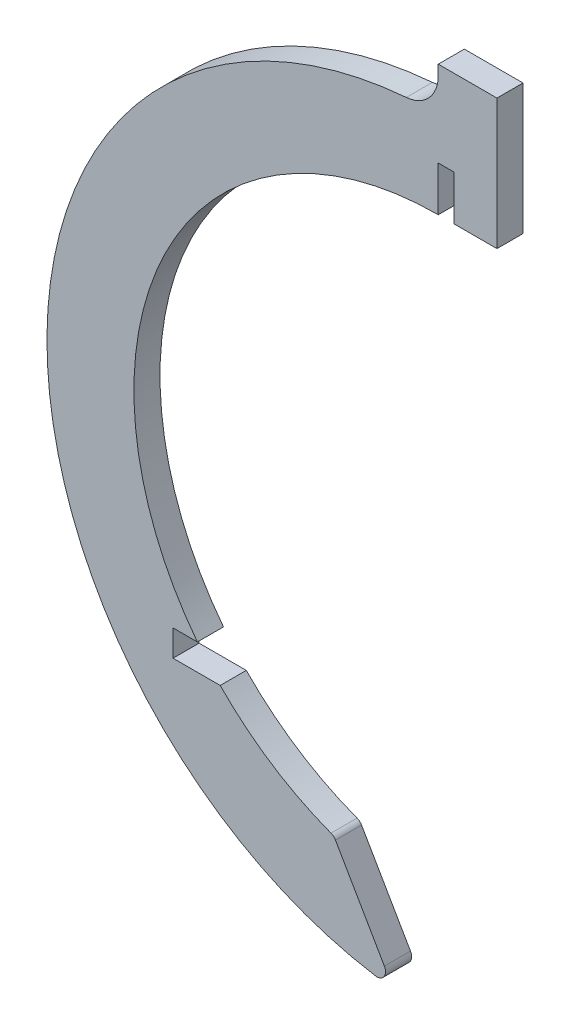
ISO-10303-21;
HEADER;
FILE_DESCRIPTION(('STEP AP214'),'2;1');
FILE_NAME('part.step','',(''),(''),'','','');
FILE_SCHEMA(('AUTOMOTIVE_DESIGN { 1 0 10303 214 1 1 1 1 }'));
ENDSEC;
DATA;
#1=APPLICATION_CONTEXT('core data for automotive mechanical design processes');
#2=APPLICATION_PROTOCOL_DEFINITION('international standard','automotive_design',2000,#1);
#3=PRODUCT_CONTEXT('',#1,'mechanical');
#4=PRODUCT('Part','Part','',(#3));
#5=PRODUCT_RELATED_PRODUCT_CATEGORY('part','',(#4));
#6=PRODUCT_DEFINITION_FORMATION('','',#4);
#7=PRODUCT_DEFINITION_CONTEXT('part definition',#1,'design');
#8=PRODUCT_DEFINITION('design','',#6,#7);
#9=PRODUCT_DEFINITION_SHAPE('','',#8);
#10=(LENGTH_UNIT() NAMED_UNIT(*) SI_UNIT(.MILLI.,.METRE.));
#11=(NAMED_UNIT(*) PLANE_ANGLE_UNIT() SI_UNIT($,.RADIAN.));
#12=(NAMED_UNIT(*) SI_UNIT($,.STERADIAN.) SOLID_ANGLE_UNIT());
#13=UNCERTAINTY_MEASURE_WITH_UNIT(LENGTH_MEASURE(1.E-05),#10,'distance_accuracy_value','');
#14=(GEOMETRIC_REPRESENTATION_CONTEXT(3) GLOBAL_UNCERTAINTY_ASSIGNED_CONTEXT((#13)) GLOBAL_UNIT_ASSIGNED_CONTEXT((#10,
#11,#12)) REPRESENTATION_CONTEXT('',''));
#15=CARTESIAN_POINT('',(0.,0.,0.));
#16=DIRECTION('',(0.,0.,1.));
#17=DIRECTION('',(1.,0.,0.));
#18=AXIS2_PLACEMENT_3D('',#15,#16,#17);
#19=CARTESIAN_POINT('',(0.,0.,3.));
#20=DIRECTION('',(0.,0.,-1.));
#21=DIRECTION('',(-1.,0.,0.));
#22=AXIS2_PLACEMENT_3D('',#19,#20,#21);
#23=CYLINDRICAL_SURFACE('',#22,35.);
#24=DIRECTION('',(0.,0.,-1.));
#25=VECTOR('',#24,1.);
#26=CARTESIAN_POINT('',(-27.698236252049,-21.3964414921191,3.));
#27=LINE('',#26,#25);
#28=CARTESIAN_POINT('',(-27.698236252049,-21.3964414921191,0.));
#29=VERTEX_POINT('',#28);
#30=CARTESIAN_POINT('',(-27.698236252049,-21.3964414921191,3.));
#31=VERTEX_POINT('',#30);
#32=EDGE_CURVE('E179',#29,#31,#27,.F.);
#33=ORIENTED_EDGE('',*,*,#32,.F.);
#34=CARTESIAN_POINT('',(0.,0.,0.));
#35=DIRECTION('',(0.,0.,1.));
#36=DIRECTION('',(1.,0.,0.));
#37=AXIS2_PLACEMENT_3D('',#34,#35,#36);
#38=CIRCLE('',#37,35.);
#39=CARTESIAN_POINT('',(0.,35.,0.));
#40=VERTEX_POINT('',#39);
#41=EDGE_CURVE('E216',#40,#29,#38,.T.);
#42=ORIENTED_EDGE('',*,*,#41,.F.);
#43=DIRECTION('',(0.,0.,-1.));
#44=VECTOR('',#43,1.);
#45=CARTESIAN_POINT('',(0.,35.,3.));
#46=LINE('',#45,#44);
#47=CARTESIAN_POINT('',(0.,35.,3.));
#48=VERTEX_POINT('',#47);
#49=EDGE_CURVE('E247',#48,#40,#46,.T.);
#50=ORIENTED_EDGE('',*,*,#49,.F.);
#51=CARTESIAN_POINT('',(0.,0.,3.));
#52=DIRECTION('',(0.,0.,1.));
#53=DIRECTION('',(1.,0.,0.));
#54=AXIS2_PLACEMENT_3D('',#51,#52,#53);
#55=CIRCLE('',#54,35.);
#56=EDGE_CURVE('E191',#48,#31,#55,.T.);
#57=ORIENTED_EDGE('',*,*,#56,.T.);
#58=EDGE_LOOP('',(#33,#42,#50,#57));
#59=FACE_BOUND('',#58,.T.);
#60=ADVANCED_FACE('F36',(#59),#23,.F.);
#61=CARTESIAN_POINT('',(0.,0.,3.));
#62=DIRECTION('',(1.,0.,0.));
#63=DIRECTION('',(0.,1.,0.));
#64=AXIS2_PLACEMENT_3D('',#61,#62,#63);
#65=PLANE('',#64);
#66=DIRECTION('',(0.,-1.,0.));
#67=VECTOR('',#66,1.);
#68=CARTESIAN_POINT('',(0.,0.,0.));
#69=LINE('',#68,#67);
#70=CARTESIAN_POINT('',(0.,50.,0.));
#71=VERTEX_POINT('',#70);
#72=CARTESIAN_POINT('',(0.,48.8364617882991,0.));
#73=VERTEX_POINT('',#72);
#74=EDGE_CURVE('E181',#71,#73,#69,.T.);
#75=ORIENTED_EDGE('',*,*,#74,.T.);
#76=DIRECTION('',(0.,0.,1.));
#77=VECTOR('',#76,1.);
#78=CARTESIAN_POINT('',(0.,48.8364617882991,3.));
#79=LINE('',#78,#77);
#80=CARTESIAN_POINT('',(0.,48.8364617882991,3.));
#81=VERTEX_POINT('',#80);
#82=EDGE_CURVE('E252',#73,#81,#79,.T.);
#83=ORIENTED_EDGE('',*,*,#82,.T.);
#84=DIRECTION('',(0.,-1.,0.));
#85=VECTOR('',#84,1.);
#86=CARTESIAN_POINT('',(0.,0.,3.));
#87=LINE('',#86,#85);
#88=CARTESIAN_POINT('',(0.,50.,3.));
#89=VERTEX_POINT('',#88);
#90=EDGE_CURVE('E182',#89,#81,#87,.T.);
#91=ORIENTED_EDGE('',*,*,#90,.F.);
#92=DIRECTION('',(0.,0.,-1.));
#93=VECTOR('',#92,1.);
#94=CARTESIAN_POINT('',(0.,50.,3.));
#95=LINE('',#94,#93);
#96=EDGE_CURVE('E207',#89,#71,#95,.T.);
#97=ORIENTED_EDGE('',*,*,#96,.T.);
#98=EDGE_LOOP('',(#75,#83,#91,#97));
#99=FACE_BOUND('',#98,.T.);
#100=ADVANCED_FACE('F308',(#99),#65,.F.);
#101=CARTESIAN_POINT('',(0.,0.,3.));
#102=DIRECTION('',(0.,0.,-1.));
#103=DIRECTION('',(-1.,0.,0.));
#104=AXIS2_PLACEMENT_3D('',#101,#102,#103);
#105=CYLINDRICAL_SURFACE('',#104,45.);
#106=CARTESIAN_POINT('',(0.,0.,0.));
#107=DIRECTION('',(0.,0.,1.));
#108=DIRECTION('',(1.,0.,0.));
#109=AXIS2_PLACEMENT_3D('',#106,#107,#108);
#110=CIRCLE('',#109,45.);
#111=CARTESIAN_POINT('',(-3.67346938775511,44.8498118463972,0.));
#112=VERTEX_POINT('',#111);
#113=CARTESIAN_POINT('',(-7.22355350067811,-44.4164414921191,0.));
#114=VERTEX_POINT('',#113);
#115=EDGE_CURVE('E210',#112,#114,#110,.T.);
#116=ORIENTED_EDGE('',*,*,#115,.T.);
#117=DIRECTION('',(0.,0.,-1.));
#118=VECTOR('',#117,1.);
#119=CARTESIAN_POINT('',(-7.22355350067811,-44.4164414921191,3.));
#120=LINE('',#119,#118);
#121=CARTESIAN_POINT('',(-7.22355350067811,-44.4164414921191,3.));
#122=VERTEX_POINT('',#121);
#123=EDGE_CURVE('E263',#114,#122,#120,.F.);
#124=ORIENTED_EDGE('',*,*,#123,.T.);
#125=CARTESIAN_POINT('',(0.,0.,3.));
#126=DIRECTION('',(0.,0.,1.));
#127=DIRECTION('',(1.,0.,0.));
#128=AXIS2_PLACEMENT_3D('',#125,#126,#127);
#129=CIRCLE('',#128,45.);
#130=CARTESIAN_POINT('',(-3.67346938775511,44.8498118463972,3.));
#131=VERTEX_POINT('',#130);
#132=EDGE_CURVE('E185',#131,#122,#129,.T.);
#133=ORIENTED_EDGE('',*,*,#132,.F.);
#134=DIRECTION('',(0.,0.,-1.));
#135=VECTOR('',#134,1.);
#136=CARTESIAN_POINT('',(-3.67346938775511,44.8498118463972,3.));
#137=LINE('',#136,#135);
#138=EDGE_CURVE('E249',#131,#112,#137,.T.);
#139=ORIENTED_EDGE('',*,*,#138,.T.);
#140=EDGE_LOOP('',(#116,#124,#133,#139));
#141=FACE_BOUND('',#140,.T.);
#142=ADVANCED_FACE('F298',(#141),#105,.T.);
#143=CARTESIAN_POINT('',(-23.2367330947878,-13.4157341073634,3.));
#144=DIRECTION('',(0.866025403784436,0.500000000000004,0.));
#145=DIRECTION('',(-0.500000000000004,0.866025403784436,0.));
#146=AXIS2_PLACEMENT_3D('',#143,#144,#145);
#147=PLANE('',#146);
#148=DIRECTION('',(0.500000000000004,-0.866025403784436,0.));
#149=VECTOR('',#148,1.);
#150=CARTESIAN_POINT('',(-23.2367330947878,-13.4157341073634,0.));
#151=LINE('',#150,#149);
#152=CARTESIAN_POINT('',(-11.819537981575,-33.1908961233748,0.));
#153=VERTEX_POINT('',#152);
#154=CARTESIAN_POINT('',(-6.1970046857675,-42.9294094589609,0.));
#155=VERTEX_POINT('',#154);
#156=EDGE_CURVE('E213',#153,#155,#151,.T.);
#157=ORIENTED_EDGE('',*,*,#156,.F.);
#158=DIRECTION('',(0.,0.,-1.));
#159=VECTOR('',#158,1.);
#160=CARTESIAN_POINT('',(-11.819537981575,-33.1908961233748,3.));
#161=LINE('',#160,#159);
#162=CARTESIAN_POINT('',(-11.819537981575,-33.1908961233748,3.));
#163=VERTEX_POINT('',#162);
#164=EDGE_CURVE('E273',#153,#163,#161,.F.);
#165=ORIENTED_EDGE('',*,*,#164,.T.);
#166=DIRECTION('',(0.500000000000004,-0.866025403784436,0.));
#167=VECTOR('',#166,1.);
#168=CARTESIAN_POINT('',(-23.2367330947878,-13.4157341073634,3.));
#169=LINE('',#168,#167);
#170=CARTESIAN_POINT('',(-6.1970046857675,-42.9294094589609,3.));
#171=VERTEX_POINT('',#170);
#172=EDGE_CURVE('E189',#163,#171,#169,.T.);
#173=ORIENTED_EDGE('',*,*,#172,.T.);
#174=DIRECTION('',(0.,0.,1.));
#175=VECTOR('',#174,1.);
#176=CARTESIAN_POINT('',(-6.1970046857675,-42.9294094589609,0.));
#177=LINE('',#176,#175);
#178=EDGE_CURVE('E258',#171,#155,#177,.F.);
#179=ORIENTED_EDGE('',*,*,#178,.T.);
#180=EDGE_LOOP('',(#157,#165,#173,#179));
#181=FACE_BOUND('',#180,.T.);
#182=ADVANCED_FACE('F289',(#181),#147,.T.);
#183=DIRECTION('',(0.,0.,-1.));
#184=VECTOR('',#183,1.);
#185=CARTESIAN_POINT('',(-25.076630253324,-24.4164414921191,3.));
#186=LINE('',#185,#184);
#187=CARTESIAN_POINT('',(-25.076630253324,-24.4164414921191,3.));
#188=VERTEX_POINT('',#187);
#189=CARTESIAN_POINT('',(-25.076630253324,-24.4164414921191,0.));
#190=VERTEX_POINT('',#189);
#191=EDGE_CURVE('E177',#188,#190,#186,.T.);
#192=ORIENTED_EDGE('',*,*,#191,.F.);
#193=CARTESIAN_POINT('',(-12.333186624655,-32.7550378977255,3.));
#194=VERTEX_POINT('',#193);
#195=EDGE_CURVE('E158',#188,#194,#55,.T.);
#196=ORIENTED_EDGE('',*,*,#195,.T.);
#197=DIRECTION('',(0.,0.,-1.));
#198=VECTOR('',#197,1.);
#199=CARTESIAN_POINT('',(-12.333186624655,-32.7550378977255,3.));
#200=LINE('',#199,#198);
#201=CARTESIAN_POINT('',(-12.333186624655,-32.7550378977255,0.));
#202=VERTEX_POINT('',#201);
#203=EDGE_CURVE('E268',#194,#202,#200,.T.);
#204=ORIENTED_EDGE('',*,*,#203,.T.);
#205=EDGE_CURVE('E215',#190,#202,#38,.T.);
#206=ORIENTED_EDGE('',*,*,#205,.F.);
#207=EDGE_LOOP('',(#192,#196,#204,#206));
#208=FACE_BOUND('',#207,.T.);
#209=ADVANCED_FACE('F281',(#208),#23,.F.);
#210=CARTESIAN_POINT('',(0.,0.,3.));
#211=DIRECTION('',(1.,0.,0.));
#212=DIRECTION('',(0.,0.,-1.));
#213=AXIS2_PLACEMENT_3D('',#210,#211,#212);
#214=PLANE('',#213);
#215=DIRECTION('',(0.,-1.,0.));
#216=VECTOR('',#215,1.);
#217=CARTESIAN_POINT('',(0.,0.,0.));
#218=LINE('',#217,#216);
#219=CARTESIAN_POINT('',(0.,40.1549479389043,0.));
#220=VERTEX_POINT('',#219);
#221=EDGE_CURVE('E219',#220,#40,#218,.T.);
#222=ORIENTED_EDGE('',*,*,#221,.F.);
#223=DIRECTION('',(0.,0.,-1.));
#224=VECTOR('',#223,1.);
#225=CARTESIAN_POINT('',(0.,40.1549479389043,3.));
#226=LINE('',#225,#224);
#227=CARTESIAN_POINT('',(0.,40.1549479389043,3.));
#228=VERTEX_POINT('',#227);
#229=EDGE_CURVE('E245',#228,#220,#226,.T.);
#230=ORIENTED_EDGE('',*,*,#229,.F.);
#231=DIRECTION('',(0.,-1.,0.));
#232=VECTOR('',#231,1.);
#233=CARTESIAN_POINT('',(0.,0.,3.));
#234=LINE('',#233,#232);
#235=EDGE_CURVE('E194',#228,#48,#234,.T.);
#236=ORIENTED_EDGE('',*,*,#235,.T.);
#237=ORIENTED_EDGE('',*,*,#49,.T.);
#238=EDGE_LOOP('',(#222,#230,#236,#237));
#239=FACE_BOUND('',#238,.T.);
#240=ADVANCED_FACE('F334',(#239),#214,.T.);
#241=CARTESIAN_POINT('',(0.,40.1549479389043,3.));
#242=DIRECTION('',(0.,1.,0.));
#243=DIRECTION('',(0.,0.,1.));
#244=AXIS2_PLACEMENT_3D('',#241,#242,#243);
#245=PLANE('',#244);
#246=DIRECTION('',(1.,0.,0.));
#247=VECTOR('',#246,1.);
#248=CARTESIAN_POINT('',(0.,40.1549479389043,0.));
#249=LINE('',#248,#247);
#250=CARTESIAN_POINT('',(1.79,40.1549479389043,0.));
#251=VERTEX_POINT('',#250);
#252=EDGE_CURVE('E222',#220,#251,#249,.T.);
#253=ORIENTED_EDGE('',*,*,#252,.T.);
#254=DIRECTION('',(0.,0.,-1.));
#255=VECTOR('',#254,1.);
#256=CARTESIAN_POINT('',(1.79,40.1549479389043,3.));
#257=LINE('',#256,#255);
#258=CARTESIAN_POINT('',(1.79,40.1549479389043,3.));
#259=VERTEX_POINT('',#258);
#260=EDGE_CURVE('E242',#259,#251,#257,.T.);
#261=ORIENTED_EDGE('',*,*,#260,.F.);
#262=DIRECTION('',(1.,0.,0.));
#263=VECTOR('',#262,1.);
#264=CARTESIAN_POINT('',(0.,40.1549479389043,3.));
#265=LINE('',#264,#263);
#266=EDGE_CURVE('E197',#228,#259,#265,.T.);
#267=ORIENTED_EDGE('',*,*,#266,.F.);
#268=ORIENTED_EDGE('',*,*,#229,.T.);
#269=EDGE_LOOP('',(#253,#261,#267,#268));
#270=FACE_BOUND('',#269,.T.);
#271=ADVANCED_FACE('F342',(#270),#245,.F.);
#272=CARTESIAN_POINT('',(1.79,0.,3.));
#273=DIRECTION('',(1.,0.,0.));
#274=DIRECTION('',(0.,1.,0.));
#275=AXIS2_PLACEMENT_3D('',#272,#273,#274);
#276=PLANE('',#275);
#277=DIRECTION('',(0.,-1.,0.));
#278=VECTOR('',#277,1.);
#279=CARTESIAN_POINT('',(1.79,0.,0.));
#280=LINE('',#279,#278);
#281=CARTESIAN_POINT('',(1.79,35.,0.));
#282=VERTEX_POINT('',#281);
#283=EDGE_CURVE('E224',#251,#282,#280,.T.);
#284=ORIENTED_EDGE('',*,*,#283,.T.);
#285=DIRECTION('',(0.,0.,-1.));
#286=VECTOR('',#285,1.);
#287=CARTESIAN_POINT('',(1.79,35.,3.));
#288=LINE('',#287,#286);
#289=CARTESIAN_POINT('',(1.79,35.,3.));
#290=VERTEX_POINT('',#289);
#291=EDGE_CURVE('E239',#290,#282,#288,.T.);
#292=ORIENTED_EDGE('',*,*,#291,.F.);
#293=DIRECTION('',(0.,-1.,0.));
#294=VECTOR('',#293,1.);
#295=CARTESIAN_POINT('',(1.79,0.,3.));
#296=LINE('',#295,#294);
#297=EDGE_CURVE('E199',#259,#290,#296,.T.);
#298=ORIENTED_EDGE('',*,*,#297,.F.);
#299=ORIENTED_EDGE('',*,*,#260,.T.);
#300=EDGE_LOOP('',(#284,#292,#298,#299));
#301=FACE_BOUND('',#300,.T.);
#302=ADVANCED_FACE('F328',(#301),#276,.F.);
#303=CARTESIAN_POINT('',(0.,35.,3.));
#304=DIRECTION('',(0.,1.,0.));
#305=DIRECTION('',(0.,0.,1.));
#306=AXIS2_PLACEMENT_3D('',#303,#304,#305);
#307=PLANE('',#306);
#308=DIRECTION('',(1.,0.,0.));
#309=VECTOR('',#308,1.);
#310=CARTESIAN_POINT('',(0.,35.,0.));
#311=LINE('',#310,#309);
#312=CARTESIAN_POINT('',(6.75,35.,0.));
#313=VERTEX_POINT('',#312);
#314=EDGE_CURVE('E226',#282,#313,#311,.T.);
#315=ORIENTED_EDGE('',*,*,#314,.T.);
#316=DIRECTION('',(0.,0.,-1.));
#317=VECTOR('',#316,1.);
#318=CARTESIAN_POINT('',(6.75,35.,3.));
#319=LINE('',#318,#317);
#320=CARTESIAN_POINT('',(6.75,35.,3.));
#321=VERTEX_POINT('',#320);
#322=EDGE_CURVE('E236',#321,#313,#319,.T.);
#323=ORIENTED_EDGE('',*,*,#322,.F.);
#324=DIRECTION('',(1.,0.,0.));
#325=VECTOR('',#324,1.);
#326=CARTESIAN_POINT('',(0.,35.,3.));
#327=LINE('',#326,#325);
#328=EDGE_CURVE('E201',#290,#321,#327,.T.);
#329=ORIENTED_EDGE('',*,*,#328,.F.);
#330=ORIENTED_EDGE('',*,*,#291,.T.);
#331=EDGE_LOOP('',(#315,#323,#329,#330));
#332=FACE_BOUND('',#331,.T.);
#333=ADVANCED_FACE('F324',(#332),#307,.F.);
#334=CARTESIAN_POINT('',(6.75,0.,3.));
#335=DIRECTION('',(-1.,0.,0.));
#336=DIRECTION('',(0.,0.,1.));
#337=AXIS2_PLACEMENT_3D('',#334,#335,#336);
#338=PLANE('',#337);
#339=DIRECTION('',(0.,1.,0.));
#340=VECTOR('',#339,1.);
#341=CARTESIAN_POINT('',(6.75,0.,0.));
#342=LINE('',#341,#340);
#343=CARTESIAN_POINT('',(6.75,50.,0.));
#344=VERTEX_POINT('',#343);
#345=EDGE_CURVE('E228',#313,#344,#342,.T.);
#346=ORIENTED_EDGE('',*,*,#345,.T.);
#347=DIRECTION('',(0.,0.,-1.));
#348=VECTOR('',#347,1.);
#349=CARTESIAN_POINT('',(6.75,50.,3.));
#350=LINE('',#349,#348);
#351=CARTESIAN_POINT('',(6.75,50.,3.));
#352=VERTEX_POINT('',#351);
#353=EDGE_CURVE('E233',#352,#344,#350,.T.);
#354=ORIENTED_EDGE('',*,*,#353,.F.);
#355=DIRECTION('',(0.,1.,0.));
#356=VECTOR('',#355,1.);
#357=CARTESIAN_POINT('',(6.75,0.,3.));
#358=LINE('',#357,#356);
#359=EDGE_CURVE('E203',#321,#352,#358,.T.);
#360=ORIENTED_EDGE('',*,*,#359,.F.);
#361=ORIENTED_EDGE('',*,*,#322,.T.);
#362=EDGE_LOOP('',(#346,#354,#360,#361));
#363=FACE_BOUND('',#362,.T.);
#364=ADVANCED_FACE('F319',(#363),#338,.F.);
#365=CARTESIAN_POINT('',(0.,50.,3.));
#366=DIRECTION('',(0.,-1.,0.));
#367=DIRECTION('',(0.,0.,-1.));
#368=AXIS2_PLACEMENT_3D('',#365,#366,#367);
#369=PLANE('',#368);
#370=DIRECTION('',(-1.,0.,0.));
#371=VECTOR('',#370,1.);
#372=CARTESIAN_POINT('',(0.,50.,0.));
#373=LINE('',#372,#371);
#374=EDGE_CURVE('E186',#344,#71,#373,.T.);
#375=ORIENTED_EDGE('',*,*,#374,.T.);
#376=ORIENTED_EDGE('',*,*,#96,.F.);
#377=DIRECTION('',(-1.,0.,0.));
#378=VECTOR('',#377,1.);
#379=CARTESIAN_POINT('',(0.,50.,3.));
#380=LINE('',#379,#378);
#381=EDGE_CURVE('E205',#352,#89,#380,.T.);
#382=ORIENTED_EDGE('',*,*,#381,.F.);
#383=ORIENTED_EDGE('',*,*,#353,.T.);
#384=EDGE_LOOP('',(#375,#376,#382,#383));
#385=FACE_BOUND('',#384,.T.);
#386=ADVANCED_FACE('F313',(#385),#369,.F.);
#387=CARTESIAN_POINT('',(0.,0.,3.));
#388=DIRECTION('',(0.,0.,1.));
#389=DIRECTION('',(1.,0.,0.));
#390=AXIS2_PLACEMENT_3D('',#387,#388,#389);
#391=PLANE('',#390);
#392=DIRECTION('',(-1.,0.,0.));
#393=VECTOR('',#392,1.);
#394=CARTESIAN_POINT('',(-34.,-21.3964414921191,3.));
#395=LINE('',#394,#393);
#396=CARTESIAN_POINT('',(-30.5,-21.3964414921191,3.));
#397=VERTEX_POINT('',#396);
#398=EDGE_CURVE('E55',#31,#397,#395,.T.);
#399=ORIENTED_EDGE('',*,*,#398,.F.);
#400=ORIENTED_EDGE('',*,*,#56,.F.);
#401=ORIENTED_EDGE('',*,*,#235,.F.);
#402=ORIENTED_EDGE('',*,*,#266,.T.);
#403=ORIENTED_EDGE('',*,*,#297,.T.);
#404=ORIENTED_EDGE('',*,*,#328,.T.);
#405=ORIENTED_EDGE('',*,*,#359,.T.);
#406=ORIENTED_EDGE('',*,*,#381,.T.);
#407=ORIENTED_EDGE('',*,*,#90,.T.);
#408=CARTESIAN_POINT('',(-4.00000000000001,48.8364617882991,3.));
#409=DIRECTION('',(0.,0.,1.));
#410=DIRECTION('',(1.,0.,0.));
#411=AXIS2_PLACEMENT_3D('',#408,#409,#410);
#412=CIRCLE('',#411,4.);
#413=EDGE_CURVE('E256',#81,#131,#412,.F.);
#414=ORIENTED_EDGE('',*,*,#413,.T.);
#415=ORIENTED_EDGE('',*,*,#132,.T.);
#416=CARTESIAN_POINT('',(-7.06303008955193,-43.4294094589609,3.));
#417=DIRECTION('',(0.,0.,1.));
#418=DIRECTION('',(1.,0.,0.));
#419=AXIS2_PLACEMENT_3D('',#416,#417,#418);
#420=CIRCLE('',#419,1.);
#421=EDGE_CURVE('E265',#122,#171,#420,.T.);
#422=ORIENTED_EDGE('',*,*,#421,.T.);
#423=ORIENTED_EDGE('',*,*,#172,.F.);
#424=CARTESIAN_POINT('',(-12.6855633853594,-33.6908961233748,3.));
#425=DIRECTION('',(0.,0.,1.));
#426=DIRECTION('',(1.,0.,0.));
#427=AXIS2_PLACEMENT_3D('',#424,#425,#426);
#428=CIRCLE('',#427,1.);
#429=EDGE_CURVE('E275',#163,#194,#428,.T.);
#430=ORIENTED_EDGE('',*,*,#429,.T.);
#431=ORIENTED_EDGE('',*,*,#195,.F.);
#432=DIRECTION('',(1.,0.,0.));
#433=VECTOR('',#432,1.);
#434=CARTESIAN_POINT('',(-34.,-24.4164414921191,3.));
#435=LINE('',#434,#433);
#436=CARTESIAN_POINT('',(-30.5,-24.4164414921191,3.));
#437=VERTEX_POINT('',#436);
#438=EDGE_CURVE('E152',#437,#188,#435,.T.);
#439=ORIENTED_EDGE('',*,*,#438,.F.);
#440=DIRECTION('',(0.,1.,0.));
#441=VECTOR('',#440,1.);
#442=CARTESIAN_POINT('',(-30.5,-21.3964414921191,3.));
#443=LINE('',#442,#441);
#444=EDGE_CURVE('E156',#437,#397,#443,.T.);
#445=ORIENTED_EDGE('',*,*,#444,.T.);
#446=EDGE_LOOP('',(#399,#400,#401,#402,#403,#404,#405,#406,#407,#414,#415,#422,#423,#430,#431,
#439,#445));
#447=FACE_BOUND('',#446,.T.);
#448=ADVANCED_FACE('F154',(#447),#391,.T.);
#449=CARTESIAN_POINT('',(0.,0.,0.));
#450=DIRECTION('',(0.,0.,1.));
#451=DIRECTION('',(1.,0.,0.));
#452=AXIS2_PLACEMENT_3D('',#449,#450,#451);
#453=PLANE('',#452);
#454=ORIENTED_EDGE('',*,*,#41,.T.);
#455=DIRECTION('',(-1.,0.,0.));
#456=VECTOR('',#455,1.);
#457=CARTESIAN_POINT('',(0.,-21.3964414921191,0.));
#458=LINE('',#457,#456);
#459=CARTESIAN_POINT('',(-30.5,-21.3964414921191,0.));
#460=VERTEX_POINT('',#459);
#461=EDGE_CURVE('E11',#29,#460,#458,.T.);
#462=ORIENTED_EDGE('',*,*,#461,.T.);
#463=DIRECTION('',(0.,1.,0.));
#464=VECTOR('',#463,1.);
#465=CARTESIAN_POINT('',(-30.5,-21.3964414921191,0.));
#466=LINE('',#465,#464);
#467=CARTESIAN_POINT('',(-30.5,-24.4164414921191,0.));
#468=VERTEX_POINT('',#467);
#469=EDGE_CURVE('E169',#468,#460,#466,.T.);
#470=ORIENTED_EDGE('',*,*,#469,.F.);
#471=DIRECTION('',(1.,0.,0.));
#472=VECTOR('',#471,1.);
#473=CARTESIAN_POINT('',(0.,-24.4164414921191,0.));
#474=LINE('',#473,#472);
#475=EDGE_CURVE('E44',#468,#190,#474,.T.);
#476=ORIENTED_EDGE('',*,*,#475,.T.);
#477=ORIENTED_EDGE('',*,*,#205,.T.);
#478=CARTESIAN_POINT('',(-12.6855633853594,-33.6908961233748,0.));
#479=DIRECTION('',(0.,0.,1.));
#480=DIRECTION('',(1.,0.,0.));
#481=AXIS2_PLACEMENT_3D('',#478,#479,#480);
#482=CIRCLE('',#481,1.);
#483=EDGE_CURVE('E271',#202,#153,#482,.F.);
#484=ORIENTED_EDGE('',*,*,#483,.T.);
#485=ORIENTED_EDGE('',*,*,#156,.T.);
#486=CARTESIAN_POINT('',(-7.06303008955193,-43.4294094589609,0.));
#487=DIRECTION('',(0.,0.,1.));
#488=DIRECTION('',(1.,0.,0.));
#489=AXIS2_PLACEMENT_3D('',#486,#487,#488);
#490=CIRCLE('',#489,1.);
#491=EDGE_CURVE('E261',#155,#114,#490,.F.);
#492=ORIENTED_EDGE('',*,*,#491,.T.);
#493=ORIENTED_EDGE('',*,*,#115,.F.);
#494=CARTESIAN_POINT('',(-4.00000000000001,48.8364617882991,0.));
#495=DIRECTION('',(0.,0.,1.));
#496=DIRECTION('',(1.,0.,0.));
#497=AXIS2_PLACEMENT_3D('',#494,#495,#496);
#498=CIRCLE('',#497,4.);
#499=EDGE_CURVE('E254',#112,#73,#498,.T.);
#500=ORIENTED_EDGE('',*,*,#499,.T.);
#501=ORIENTED_EDGE('',*,*,#74,.F.);
#502=ORIENTED_EDGE('',*,*,#374,.F.);
#503=ORIENTED_EDGE('',*,*,#345,.F.);
#504=ORIENTED_EDGE('',*,*,#314,.F.);
#505=ORIENTED_EDGE('',*,*,#283,.F.);
#506=ORIENTED_EDGE('',*,*,#252,.F.);
#507=ORIENTED_EDGE('',*,*,#221,.T.);
#508=EDGE_LOOP('',(#454,#462,#470,#476,#477,#484,#485,#492,#493,#500,#501,#502,#503,#504,#505,
#506,#507));
#509=FACE_BOUND('',#508,.T.);
#510=ADVANCED_FACE('F277',(#509),#453,.F.);
#511=CARTESIAN_POINT('',(-4.00000000000001,48.8364617882991,3.));
#512=DIRECTION('',(0.,0.,-1.));
#513=DIRECTION('',(-1.,0.,0.));
#514=AXIS2_PLACEMENT_3D('',#511,#512,#513);
#515=CYLINDRICAL_SURFACE('',#514,4.);
#516=ORIENTED_EDGE('',*,*,#413,.F.);
#517=ORIENTED_EDGE('',*,*,#82,.F.);
#518=ORIENTED_EDGE('',*,*,#499,.F.);
#519=ORIENTED_EDGE('',*,*,#138,.F.);
#520=EDGE_LOOP('',(#516,#517,#518,#519));
#521=FACE_BOUND('',#520,.T.);
#522=ADVANCED_FACE('F303',(#521),#515,.F.);
#523=CARTESIAN_POINT('',(-7.06303008955193,-43.4294094589609,3.));
#524=DIRECTION('',(0.,0.,-1.));
#525=DIRECTION('',(-1.,0.,0.));
#526=AXIS2_PLACEMENT_3D('',#523,#524,#525);
#527=CYLINDRICAL_SURFACE('',#526,1.);
#528=ORIENTED_EDGE('',*,*,#421,.F.);
#529=ORIENTED_EDGE('',*,*,#123,.F.);
#530=ORIENTED_EDGE('',*,*,#491,.F.);
#531=ORIENTED_EDGE('',*,*,#178,.F.);
#532=EDGE_LOOP('',(#528,#529,#530,#531));
#533=FACE_BOUND('',#532,.T.);
#534=ADVANCED_FACE('F294',(#533),#527,.T.);
#535=CARTESIAN_POINT('',(-12.6855633853594,-33.6908961233748,3.));
#536=DIRECTION('',(0.,0.,-1.));
#537=DIRECTION('',(-1.,0.,0.));
#538=AXIS2_PLACEMENT_3D('',#535,#536,#537);
#539=CYLINDRICAL_SURFACE('',#538,1.);
#540=ORIENTED_EDGE('',*,*,#429,.F.);
#541=ORIENTED_EDGE('',*,*,#164,.F.);
#542=ORIENTED_EDGE('',*,*,#483,.F.);
#543=ORIENTED_EDGE('',*,*,#203,.F.);
#544=EDGE_LOOP('',(#540,#541,#542,#543));
#545=FACE_BOUND('',#544,.T.);
#546=ADVANCED_FACE('F38',(#545),#539,.T.);
#547=CARTESIAN_POINT('',(-34.,-21.3964414921191,-7.));
#548=DIRECTION('',(0.,1.,0.));
#549=DIRECTION('',(0.,0.,1.));
#550=AXIS2_PLACEMENT_3D('',#547,#548,#549);
#551=PLANE('',#550);
#552=ORIENTED_EDGE('',*,*,#398,.T.);
#553=DIRECTION('',(0.,0.,1.));
#554=VECTOR('',#553,1.);
#555=CARTESIAN_POINT('',(-30.5,-21.3964414921191,0.));
#556=LINE('',#555,#554);
#557=EDGE_CURVE('E51',#460,#397,#556,.T.);
#558=ORIENTED_EDGE('',*,*,#557,.F.);
#559=ORIENTED_EDGE('',*,*,#461,.F.);
#560=ORIENTED_EDGE('',*,*,#32,.T.);
#561=EDGE_LOOP('',(#552,#558,#559,#560));
#562=FACE_BOUND('',#561,.T.);
#563=ADVANCED_FACE('F341',(#562),#551,.F.);
#564=CARTESIAN_POINT('',(-34.,-24.4164414921191,-7.));
#565=DIRECTION('',(0.,-1.,0.));
#566=DIRECTION('',(0.,0.,-1.));
#567=AXIS2_PLACEMENT_3D('',#564,#565,#566);
#568=PLANE('',#567);
#569=ORIENTED_EDGE('',*,*,#475,.F.);
#570=DIRECTION('',(0.,0.,1.));
#571=VECTOR('',#570,1.);
#572=CARTESIAN_POINT('',(-30.5,-24.4164414921191,0.));
#573=LINE('',#572,#571);
#574=EDGE_CURVE('E164',#468,#437,#573,.T.);
#575=ORIENTED_EDGE('',*,*,#574,.T.);
#576=ORIENTED_EDGE('',*,*,#438,.T.);
#577=ORIENTED_EDGE('',*,*,#191,.T.);
#578=EDGE_LOOP('',(#569,#575,#576,#577));
#579=FACE_BOUND('',#578,.T.);
#580=ADVANCED_FACE('F165',(#579),#568,.F.);
#581=CARTESIAN_POINT('',(-30.5,-21.3964414921191,0.));
#582=DIRECTION('',(1.,0.,0.));
#583=DIRECTION('',(0.,0.,-1.));
#584=AXIS2_PLACEMENT_3D('',#581,#582,#583);
#585=PLANE('',#584);
#586=ORIENTED_EDGE('',*,*,#444,.F.);
#587=ORIENTED_EDGE('',*,*,#574,.F.);
#588=ORIENTED_EDGE('',*,*,#469,.T.);
#589=ORIENTED_EDGE('',*,*,#557,.T.);
#590=EDGE_LOOP('',(#586,#587,#588,#589));
#591=FACE_BOUND('',#590,.T.);
#592=ADVANCED_FACE('F171',(#591),#585,.T.);
#593=CLOSED_SHELL('',(#60,#100,#142,#182,#209,#240,#271,#302,#333,#364,#386,#448,#510,#522,#534,
#546,#563,#580,#592));
#594=MANIFOLD_SOLID_BREP('B2',#593);
#595=ADVANCED_BREP_SHAPE_REPRESENTATION('',(#18,#594),#14);
#596=SHAPE_DEFINITION_REPRESENTATION(#9,#595);
ENDSEC;
END-ISO-10303-21;
